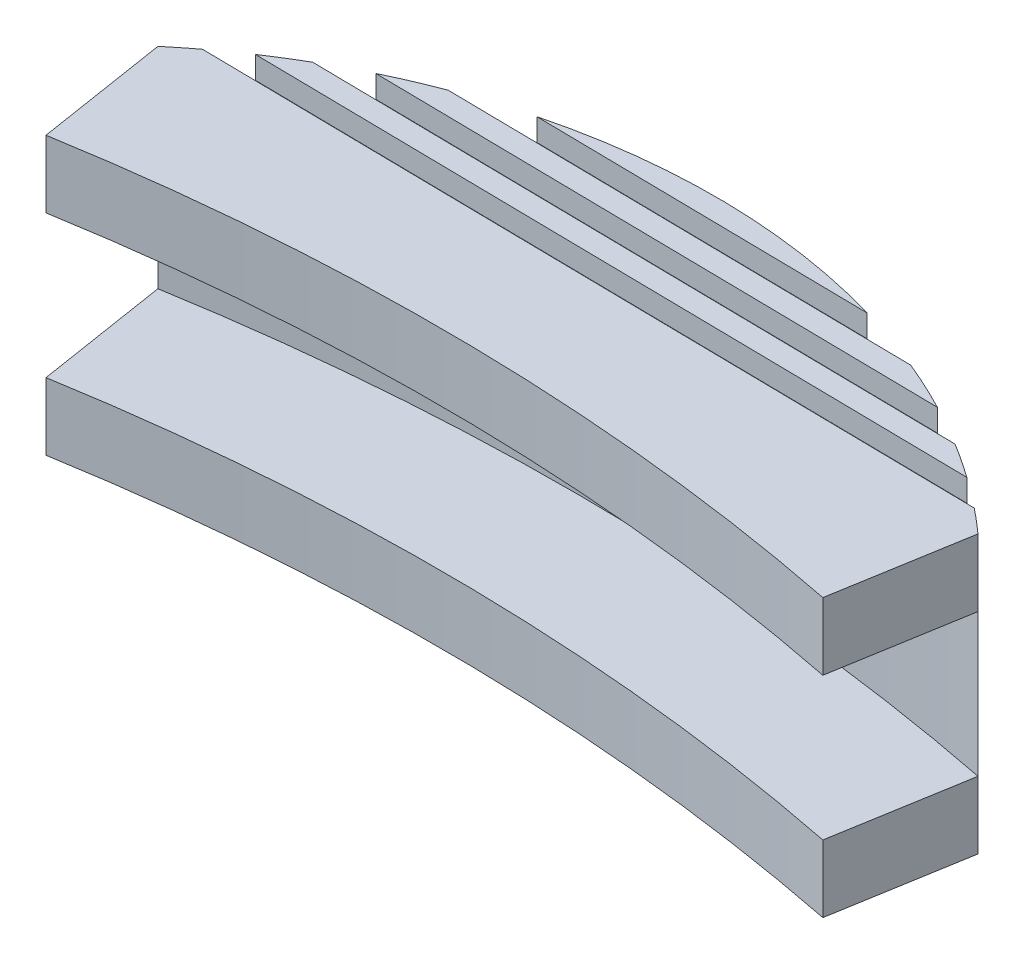
ISO-10303-21;
HEADER;
FILE_DESCRIPTION(('STEP AP214'),'2;1');
FILE_NAME('part.step','',(''),(''),'','','');
FILE_SCHEMA(('AUTOMOTIVE_DESIGN { 1 0 10303 214 1 1 1 1 }'));
ENDSEC;
DATA;
#1=APPLICATION_CONTEXT('core data for automotive mechanical design processes');
#2=APPLICATION_PROTOCOL_DEFINITION('international standard','automotive_design',2000,#1);
#3=PRODUCT_CONTEXT('',#1,'mechanical');
#4=PRODUCT('Part','Part','',(#3));
#5=PRODUCT_RELATED_PRODUCT_CATEGORY('part','',(#4));
#6=PRODUCT_DEFINITION_FORMATION('','',#4);
#7=PRODUCT_DEFINITION_CONTEXT('part definition',#1,'design');
#8=PRODUCT_DEFINITION('design','',#6,#7);
#9=PRODUCT_DEFINITION_SHAPE('','',#8);
#10=(LENGTH_UNIT() NAMED_UNIT(*) SI_UNIT(.MILLI.,.METRE.));
#11=(NAMED_UNIT(*) PLANE_ANGLE_UNIT() SI_UNIT($,.RADIAN.));
#12=(NAMED_UNIT(*) SI_UNIT($,.STERADIAN.) SOLID_ANGLE_UNIT());
#13=UNCERTAINTY_MEASURE_WITH_UNIT(LENGTH_MEASURE(1.E-05),#10,'distance_accuracy_value','');
#14=(GEOMETRIC_REPRESENTATION_CONTEXT(3) GLOBAL_UNCERTAINTY_ASSIGNED_CONTEXT((#13)) GLOBAL_UNIT_ASSIGNED_CONTEXT((#10,
#11,#12)) REPRESENTATION_CONTEXT('',''));
#15=CARTESIAN_POINT('',(0.,0.,0.));
#16=DIRECTION('',(0.,0.,1.));
#17=DIRECTION('',(1.,0.,0.));
#18=AXIS2_PLACEMENT_3D('',#15,#16,#17);
#19=CARTESIAN_POINT('',(-48.9061099360698,-35.3615888271444,-205.982538335919));
#20=DIRECTION('',(0.,1.,0.));
#21=DIRECTION('',(-1.,0.,0.));
#22=AXIS2_PLACEMENT_3D('',#19,#20,#21);
#23=PLANE('',#22);
#24=DIRECTION('',(0.999893185877506,0.,0.0146156366858123));
#25=VECTOR('',#24,1.);
#26=CARTESIAN_POINT('',(4.49370903338518,-35.3615888271444,-307.426158599009));
#27=LINE('',#26,#25);
#28=CARTESIAN_POINT('',(-64.8725313397905,-35.3615888271444,-308.440098669683));
#29=VERTEX_POINT('',#28);
#30=CARTESIAN_POINT('',(-29.9518648746335,-35.3615888271444,-307.929656373356));
#31=VERTEX_POINT('',#30);
#32=EDGE_CURVE('E290',#29,#31,#27,.T.);
#33=ORIENTED_EDGE('',*,*,#32,.T.);
#34=CARTESIAN_POINT('',(-47.7397447251398,-35.3615888271444,-285.776573431618));
#35=DIRECTION('',(0.,1.,0.));
#36=DIRECTION('',(-1.,0.,0.));
#37=AXIS2_PLACEMENT_3D('',#34,#35,#36);
#38=CIRCLE('',#37,28.4106978689293);
#39=CARTESIAN_POINT('',(-28.8689573308058,-35.3615888271444,-307.014773367522));
#40=VERTEX_POINT('',#39);
#41=EDGE_CURVE('E451',#40,#31,#38,.T.);
#42=ORIENTED_EDGE('',*,*,#41,.F.);
#43=DIRECTION('',(-0.166595258524325,0.,0.986025364702761));
#44=VECTOR('',#43,1.);
#45=CARTESIAN_POINT('',(-28.8689573308058,-35.3615888271444,-307.014773367522));
#46=LINE('',#45,#44);
#47=CARTESIAN_POINT('',(-29.8689573308058,-35.3615888271444,-301.096085324195));
#48=VERTEX_POINT('',#47);
#49=EDGE_CURVE('E467',#40,#48,#46,.T.);
#50=ORIENTED_EDGE('',*,*,#49,.T.);
#51=CARTESIAN_POINT('',(-48.9061099360698,-35.3615888271444,-205.982538335933));
#52=DIRECTION('',(0.,1.,0.));
#53=DIRECTION('',(-1.,0.,0.));
#54=AXIS2_PLACEMENT_3D('',#51,#52,#53);
#55=CIRCLE('',#54,97.0000000000232);
#56=CARTESIAN_POINT('',(-65.0444673599447,-35.3615888271444,-301.630608989051));
#57=VERTEX_POINT('',#56);
#58=EDGE_CURVE('E469',#48,#57,#55,.T.);
#59=ORIENTED_EDGE('',*,*,#58,.T.);
#60=DIRECTION('',(-0.156200383658451,0.,-0.987725387010455));
#61=VECTOR('',#60,1.);
#62=CARTESIAN_POINT('',(-65.9817165677481,-35.3615888271444,-307.557257917948));
#63=LINE('',#62,#61);
#64=CARTESIAN_POINT('',(-65.9817165677481,-35.3615888271444,-307.557257917948));
#65=VERTEX_POINT('',#64);
#66=EDGE_CURVE('E472',#57,#65,#63,.T.);
#67=ORIENTED_EDGE('',*,*,#66,.T.);
#68=EDGE_CURVE('E449',#29,#65,#38,.T.);
#69=ORIENTED_EDGE('',*,*,#68,.F.);
#70=EDGE_LOOP('',(#33,#42,#50,#59,#67,#69));
#71=FACE_BOUND('',#70,.T.);
#72=ADVANCED_FACE('F60',(#71),#23,.F.);
#73=CARTESIAN_POINT('',(-31.3025015736685,-35.3615888271444,-308.949505722957));
#74=VERTEX_POINT('',#73);
#75=CARTESIAN_POINT('',(-32.8488535552888,-35.3615888271444,-309.972215881597));
#76=VERTEX_POINT('',#75);
#77=EDGE_CURVE('E454',#74,#76,#38,.T.);
#78=ORIENTED_EDGE('',*,*,#77,.F.);
#79=DIRECTION('',(0.999893185877506,0.,0.0146156366858128));
#80=VECTOR('',#79,1.);
#81=CARTESIAN_POINT('',(4.50832467007113,-35.3615888271444,-308.426051784887));
#82=LINE('',#81,#80);
#83=CARTESIAN_POINT('',(-63.4926633673838,-35.3615888271444,-309.420035691837));
#84=VERTEX_POINT('',#83);
#85=EDGE_CURVE('E275',#84,#74,#82,.T.);
#86=ORIENTED_EDGE('',*,*,#85,.F.);
#87=CARTESIAN_POINT('',(-61.9170801123919,-35.3615888271444,-310.397111904952));
#88=VERTEX_POINT('',#87);
#89=EDGE_CURVE('E304',#88,#84,#38,.T.);
#90=ORIENTED_EDGE('',*,*,#89,.F.);
#91=DIRECTION('',(0.999893185877506,0.,0.0146156366858129));
#92=VECTOR('',#91,1.);
#93=CARTESIAN_POINT('',(4.52294030675697,-35.3615888271444,-309.425944970764));
#94=LINE('',#93,#92);
#95=EDGE_CURVE('E319',#88,#76,#94,.T.);
#96=ORIENTED_EDGE('',*,*,#95,.T.);
#97=EDGE_LOOP('',(#78,#86,#90,#96));
#98=FACE_BOUND('',#97,.T.);
#99=ADVANCED_FACE('F528',(#98),#23,.F.);
#100=CARTESIAN_POINT('',(-34.6628525550382,-35.3615888271444,-310.998838289697));
#101=VERTEX_POINT('',#100);
#102=CARTESIAN_POINT('',(-36.8838086299912,-35.3615888271444,-312.031409269947));
#103=VERTEX_POINT('',#102);
#104=EDGE_CURVE('E522',#101,#103,#38,.T.);
#105=ORIENTED_EDGE('',*,*,#104,.F.);
#106=DIRECTION('',(0.999893185877506,0.,0.0146156366858138));
#107=VECTOR('',#106,1.);
#108=CARTESIAN_POINT('',(4.53755594344308,-35.3615888271444,-310.425838156642));
#109=LINE('',#108,#107);
#110=CARTESIAN_POINT('',(-60.0738498392709,-35.3615888271444,-311.370275868607));
#111=VERTEX_POINT('',#110);
#112=EDGE_CURVE('E325',#111,#101,#109,.T.);
#113=ORIENTED_EDGE('',*,*,#112,.F.);
#114=CARTESIAN_POINT('',(-57.8236624909465,-35.3615888271444,-312.337491260112));
#115=VERTEX_POINT('',#114);
#116=EDGE_CURVE('E516',#115,#111,#38,.T.);
#117=ORIENTED_EDGE('',*,*,#116,.F.);
#118=DIRECTION('',(0.999893185877506,0.,0.0146156366858094));
#119=VECTOR('',#118,1.);
#120=CARTESIAN_POINT('',(4.55217158012753,-35.3615888271444,-311.425731342519));
#121=LINE('',#120,#119);
#122=EDGE_CURVE('E341',#115,#103,#121,.T.);
#123=ORIENTED_EDGE('',*,*,#122,.T.);
#124=EDGE_LOOP('',(#105,#113,#117,#123));
#125=FACE_BOUND('',#124,.T.);
#126=ADVANCED_FACE('F540',(#125),#23,.F.);
#127=CARTESIAN_POINT('',(-47.7397447251398,14.7979035606973,-285.776573431618));
#128=DIRECTION('',(0.,-1.,0.));
#129=DIRECTION('',(1.,0.,0.));
#130=AXIS2_PLACEMENT_3D('',#127,#128,#129);
#131=CYLINDRICAL_SURFACE('',#130,28.4106978689293);
#132=DIRECTION('',(0.,-1.,0.));
#133=VECTOR('',#132,1.);
#134=CARTESIAN_POINT('',(-31.3025015736685,-34.3615888271444,-308.949505722957));
#135=LINE('',#134,#133);
#136=CARTESIAN_POINT('',(-31.3025015736685,-34.3615888271444,-308.949505722957));
#137=VERTEX_POINT('',#136);
#138=EDGE_CURVE('E269',#137,#74,#135,.T.);
#139=ORIENTED_EDGE('',*,*,#138,.T.);
#140=ORIENTED_EDGE('',*,*,#77,.T.);
#141=DIRECTION('',(0.,-1.,0.));
#142=VECTOR('',#141,1.);
#143=CARTESIAN_POINT('',(-32.8488535552887,-34.3615888271444,-309.972215881597));
#144=LINE('',#143,#142);
#145=CARTESIAN_POINT('',(-32.8488535552887,-34.3615888271444,-309.972215881597));
#146=VERTEX_POINT('',#145);
#147=EDGE_CURVE('E83',#146,#76,#144,.T.);
#148=ORIENTED_EDGE('',*,*,#147,.F.);
#149=CARTESIAN_POINT('',(-47.7397447251398,-34.3615888271444,-285.776573431618));
#150=DIRECTION('',(0.,1.,0.));
#151=DIRECTION('',(0.,0.,1.));
#152=AXIS2_PLACEMENT_3D('',#149,#150,#151);
#153=CIRCLE('',#152,28.4106978689293);
#154=CARTESIAN_POINT('',(-34.6628525550382,-34.3615888271444,-310.998838289697));
#155=VERTEX_POINT('',#154);
#156=EDGE_CURVE('E318',#146,#155,#153,.T.);
#157=ORIENTED_EDGE('',*,*,#156,.T.);
#158=DIRECTION('',(0.,-1.,0.));
#159=VECTOR('',#158,1.);
#160=CARTESIAN_POINT('',(-34.6628525550382,-34.3615888271444,-310.998838289697));
#161=LINE('',#160,#159);
#162=EDGE_CURVE('E334',#155,#101,#161,.T.);
#163=ORIENTED_EDGE('',*,*,#162,.T.);
#164=ORIENTED_EDGE('',*,*,#104,.T.);
#165=DIRECTION('',(0.,-1.,0.));
#166=VECTOR('',#165,1.);
#167=CARTESIAN_POINT('',(-36.8838086299912,-34.3615888271444,-312.031409269947));
#168=LINE('',#167,#166);
#169=CARTESIAN_POINT('',(-36.8838086299912,-34.3615888271444,-312.031409269947));
#170=VERTEX_POINT('',#169);
#171=EDGE_CURVE('E75',#170,#103,#168,.T.);
#172=ORIENTED_EDGE('',*,*,#171,.F.);
#173=CARTESIAN_POINT('',(-47.7397447251398,-34.3615888271444,-285.776573431618));
#174=DIRECTION('',(0.,1.,0.));
#175=DIRECTION('',(0.,0.,1.));
#176=AXIS2_PLACEMENT_3D('',#173,#174,#175);
#177=CIRCLE('',#176,28.4106978689293);
#178=CARTESIAN_POINT('',(-39.8685462277447,-34.3615888271444,-313.075144595951));
#179=VERTEX_POINT('',#178);
#180=EDGE_CURVE('E340',#170,#179,#177,.T.);
#181=ORIENTED_EDGE('',*,*,#180,.T.);
#182=DIRECTION('',(0.,-1.,0.));
#183=VECTOR('',#182,1.);
#184=CARTESIAN_POINT('',(-39.8685462277447,-34.3615888271444,-313.075144595951));
#185=LINE('',#184,#183);
#186=CARTESIAN_POINT('',(-39.8685462277447,-35.3615888271444,-313.075144595951));
#187=VERTEX_POINT('',#186);
#188=EDGE_CURVE('E355',#179,#187,#185,.T.);
#189=ORIENTED_EDGE('',*,*,#188,.T.);
#190=CARTESIAN_POINT('',(-54.8096936198211,-35.3615888271444,-313.293542305863));
#191=VERTEX_POINT('',#190);
#192=EDGE_CURVE('E518',#187,#191,#38,.T.);
#193=ORIENTED_EDGE('',*,*,#192,.T.);
#194=DIRECTION('',(0.,-1.,0.));
#195=VECTOR('',#194,1.);
#196=CARTESIAN_POINT('',(-54.8096936198211,-34.3615888271444,-313.293542305863));
#197=LINE('',#196,#195);
#198=CARTESIAN_POINT('',(-54.8096936198211,-34.3615888271444,-313.293542305863));
#199=VERTEX_POINT('',#198);
#200=EDGE_CURVE('E327',#199,#191,#197,.T.);
#201=ORIENTED_EDGE('',*,*,#200,.F.);
#202=CARTESIAN_POINT('',(-57.8236624909465,-34.3615888271444,-312.337491260112));
#203=VERTEX_POINT('',#202);
#204=EDGE_CURVE('E345',#199,#203,#177,.T.);
#205=ORIENTED_EDGE('',*,*,#204,.T.);
#206=DIRECTION('',(0.,-1.,0.));
#207=VECTOR('',#206,1.);
#208=CARTESIAN_POINT('',(-57.8236624909465,-34.3615888271444,-312.337491260112));
#209=LINE('',#208,#207);
#210=EDGE_CURVE('E351',#203,#115,#209,.T.);
#211=ORIENTED_EDGE('',*,*,#210,.T.);
#212=ORIENTED_EDGE('',*,*,#116,.T.);
#213=DIRECTION('',(0.,-1.,0.));
#214=VECTOR('',#213,1.);
#215=CARTESIAN_POINT('',(-60.0738498392709,-34.3615888271444,-311.370275868607));
#216=LINE('',#215,#214);
#217=CARTESIAN_POINT('',(-60.0738498392709,-34.3615888271444,-311.370275868607));
#218=VERTEX_POINT('',#217);
#219=EDGE_CURVE('E329',#218,#111,#216,.T.);
#220=ORIENTED_EDGE('',*,*,#219,.F.);
#221=CARTESIAN_POINT('',(-61.9170801123919,-34.3615888271444,-310.397111904952));
#222=VERTEX_POINT('',#221);
#223=EDGE_CURVE('E323',#218,#222,#153,.T.);
#224=ORIENTED_EDGE('',*,*,#223,.T.);
#225=DIRECTION('',(0.,-1.,0.));
#226=VECTOR('',#225,1.);
#227=CARTESIAN_POINT('',(-61.9170801123919,-34.3615888271444,-310.397111904952));
#228=LINE('',#227,#226);
#229=EDGE_CURVE('E331',#222,#88,#228,.T.);
#230=ORIENTED_EDGE('',*,*,#229,.T.);
#231=ORIENTED_EDGE('',*,*,#89,.T.);
#232=DIRECTION('',(0.,-1.,0.));
#233=VECTOR('',#232,1.);
#234=CARTESIAN_POINT('',(-63.4926633673838,-34.3615888271444,-309.420035691837));
#235=LINE('',#234,#233);
#236=CARTESIAN_POINT('',(-63.4926633673838,-34.3615888271444,-309.420035691837));
#237=VERTEX_POINT('',#236);
#238=EDGE_CURVE('E301',#237,#84,#235,.T.);
#239=ORIENTED_EDGE('',*,*,#238,.F.);
#240=CARTESIAN_POINT('',(-47.7397447251398,-34.3615888271444,-285.776573431618));
#241=DIRECTION('',(0.,1.,0.));
#242=DIRECTION('',(0.,0.,1.));
#243=AXIS2_PLACEMENT_3D('',#240,#241,#242);
#244=CIRCLE('',#243,28.4106978689293);
#245=CARTESIAN_POINT('',(-64.8725313397905,-34.3615888271444,-308.440098669683));
#246=VERTEX_POINT('',#245);
#247=EDGE_CURVE('E281',#237,#246,#244,.T.);
#248=ORIENTED_EDGE('',*,*,#247,.T.);
#249=DIRECTION('',(0.,-1.,0.));
#250=VECTOR('',#249,1.);
#251=CARTESIAN_POINT('',(-64.8725313397905,-34.3615888271444,-308.440098669683));
#252=LINE('',#251,#250);
#253=EDGE_CURVE('E298',#246,#29,#252,.T.);
#254=ORIENTED_EDGE('',*,*,#253,.T.);
#255=ORIENTED_EDGE('',*,*,#68,.T.);
#256=DIRECTION('',(0.,1.,0.));
#257=VECTOR('',#256,1.);
#258=CARTESIAN_POINT('',(-65.9817165677481,-35.3615888271444,-307.557257917948));
#259=LINE('',#258,#257);
#260=CARTESIAN_POINT('',(-65.9817165677481,-32.3615888271444,-307.557257917948));
#261=VERTEX_POINT('',#260);
#262=EDGE_CURVE('E475',#65,#261,#259,.T.);
#263=ORIENTED_EDGE('',*,*,#262,.T.);
#264=DIRECTION('',(0.,-1.,0.));
#265=VECTOR('',#264,1.);
#266=CARTESIAN_POINT('',(-65.9817165677481,14.7979035606973,-307.557257917948));
#267=LINE('',#266,#265);
#268=CARTESIAN_POINT('',(-65.9817165677481,-26.0015888271444,-307.557257917948));
#269=VERTEX_POINT('',#268);
#270=EDGE_CURVE('E463',#269,#261,#267,.T.);
#271=ORIENTED_EDGE('',*,*,#270,.F.);
#272=CARTESIAN_POINT('',(-65.9817165677481,-23.0015888271444,-307.557257917948));
#273=VERTEX_POINT('',#272);
#274=EDGE_CURVE('E464',#273,#269,#267,.T.);
#275=ORIENTED_EDGE('',*,*,#274,.F.);
#276=CARTESIAN_POINT('',(-47.7397447251398,-23.0015888271444,-285.776573431618));
#277=DIRECTION('',(0.,1.,0.));
#278=DIRECTION('',(-1.,0.,0.));
#279=AXIS2_PLACEMENT_3D('',#276,#277,#278);
#280=CIRCLE('',#279,28.4106978689293);
#281=CARTESIAN_POINT('',(-64.8725313397905,-23.0015888271444,-308.440098669683));
#282=VERTEX_POINT('',#281);
#283=EDGE_CURVE('E455',#273,#282,#280,.F.);
#284=ORIENTED_EDGE('',*,*,#283,.T.);
#285=DIRECTION('',(0.,1.,0.));
#286=VECTOR('',#285,1.);
#287=CARTESIAN_POINT('',(-64.8725313397905,-24.0015888271444,-308.440098669683));
#288=LINE('',#287,#286);
#289=CARTESIAN_POINT('',(-64.8725313397905,-24.0015888271444,-308.440098669683));
#290=VERTEX_POINT('',#289);
#291=EDGE_CURVE('E379',#290,#282,#288,.T.);
#292=ORIENTED_EDGE('',*,*,#291,.F.);
#293=CARTESIAN_POINT('',(-47.7397447251398,-24.0015888271444,-285.776573431618));
#294=DIRECTION('',(0.,1.,0.));
#295=DIRECTION('',(0.,0.,1.));
#296=AXIS2_PLACEMENT_3D('',#293,#294,#295);
#297=CIRCLE('',#296,28.4106978689293);
#298=CARTESIAN_POINT('',(-63.4926633673838,-24.0015888271444,-309.420035691837));
#299=VERTEX_POINT('',#298);
#300=EDGE_CURVE('E360',#299,#290,#297,.T.);
#301=ORIENTED_EDGE('',*,*,#300,.F.);
#302=DIRECTION('',(0.,1.,0.));
#303=VECTOR('',#302,1.);
#304=CARTESIAN_POINT('',(-63.4926633673838,-24.0015888271444,-309.420035691837));
#305=LINE('',#304,#303);
#306=CARTESIAN_POINT('',(-63.4926633673838,-23.0015888271444,-309.420035691837));
#307=VERTEX_POINT('',#306);
#308=EDGE_CURVE('E381',#299,#307,#305,.T.);
#309=ORIENTED_EDGE('',*,*,#308,.T.);
#310=CARTESIAN_POINT('',(-61.9170801123919,-23.0015888271444,-310.397111904952));
#311=VERTEX_POINT('',#310);
#312=EDGE_CURVE('E459',#307,#311,#280,.F.);
#313=ORIENTED_EDGE('',*,*,#312,.T.);
#314=DIRECTION('',(0.,1.,0.));
#315=VECTOR('',#314,1.);
#316=CARTESIAN_POINT('',(-61.9170801123919,-24.0015888271444,-310.397111904952));
#317=LINE('',#316,#315);
#318=CARTESIAN_POINT('',(-61.9170801123919,-24.0015888271444,-310.397111904952));
#319=VERTEX_POINT('',#318);
#320=EDGE_CURVE('E403',#319,#311,#317,.T.);
#321=ORIENTED_EDGE('',*,*,#320,.F.);
#322=CARTESIAN_POINT('',(-47.7397447251398,-24.0015888271444,-285.776573431618));
#323=DIRECTION('',(0.,1.,0.));
#324=DIRECTION('',(0.,0.,1.));
#325=AXIS2_PLACEMENT_3D('',#322,#323,#324);
#326=CIRCLE('',#325,28.4106978689293);
#327=CARTESIAN_POINT('',(-60.0738498392709,-24.0015888271444,-311.370275868607));
#328=VERTEX_POINT('',#327);
#329=EDGE_CURVE('E386',#328,#319,#326,.T.);
#330=ORIENTED_EDGE('',*,*,#329,.F.);
#331=DIRECTION('',(0.,1.,0.));
#332=VECTOR('',#331,1.);
#333=CARTESIAN_POINT('',(-60.0738498392709,-24.0015888271444,-311.370275868607));
#334=LINE('',#333,#332);
#335=CARTESIAN_POINT('',(-60.0738498392709,-23.0015888271444,-311.370275868607));
#336=VERTEX_POINT('',#335);
#337=EDGE_CURVE('E405',#328,#336,#334,.T.);
#338=ORIENTED_EDGE('',*,*,#337,.T.);
#339=CARTESIAN_POINT('',(-57.8236624909465,-23.0015888271444,-312.337491260112));
#340=VERTEX_POINT('',#339);
#341=EDGE_CURVE('E934',#336,#340,#280,.F.);
#342=ORIENTED_EDGE('',*,*,#341,.T.);
#343=DIRECTION('',(0.,1.,0.));
#344=VECTOR('',#343,1.);
#345=CARTESIAN_POINT('',(-57.8236624909465,-24.0015888271444,-312.337491260112));
#346=LINE('',#345,#344);
#347=CARTESIAN_POINT('',(-57.8236624909465,-24.0015888271444,-312.337491260112));
#348=VERTEX_POINT('',#347);
#349=EDGE_CURVE('E422',#348,#340,#346,.T.);
#350=ORIENTED_EDGE('',*,*,#349,.F.);
#351=CARTESIAN_POINT('',(-47.7397447251398,-24.0015888271444,-285.776573431618));
#352=DIRECTION('',(0.,1.,0.));
#353=DIRECTION('',(0.,0.,1.));
#354=AXIS2_PLACEMENT_3D('',#351,#352,#353);
#355=CIRCLE('',#354,28.4106978689293);
#356=CARTESIAN_POINT('',(-54.8096936198211,-24.0015888271444,-313.293542305863));
#357=VERTEX_POINT('',#356);
#358=EDGE_CURVE('E410',#357,#348,#355,.T.);
#359=ORIENTED_EDGE('',*,*,#358,.F.);
#360=DIRECTION('',(0.,1.,0.));
#361=VECTOR('',#360,1.);
#362=CARTESIAN_POINT('',(-54.8096936198211,-24.0015888271444,-313.293542305863));
#363=LINE('',#362,#361);
#364=CARTESIAN_POINT('',(-54.8096936198211,-23.0015888271444,-313.293542305863));
#365=VERTEX_POINT('',#364);
#366=EDGE_CURVE('E424',#357,#365,#363,.T.);
#367=ORIENTED_EDGE('',*,*,#366,.T.);
#368=CARTESIAN_POINT('',(-39.8685462277447,-23.0015888271444,-313.075144595951));
#369=VERTEX_POINT('',#368);
#370=EDGE_CURVE('E936',#365,#369,#280,.F.);
#371=ORIENTED_EDGE('',*,*,#370,.T.);
#372=DIRECTION('',(0.,1.,0.));
#373=VECTOR('',#372,1.);
#374=CARTESIAN_POINT('',(-39.8685462277447,-24.0015888271444,-313.075144595951));
#375=LINE('',#374,#373);
#376=CARTESIAN_POINT('',(-39.8685462277447,-24.0015888271444,-313.075144595951));
#377=VERTEX_POINT('',#376);
#378=EDGE_CURVE('E397',#377,#369,#375,.T.);
#379=ORIENTED_EDGE('',*,*,#378,.F.);
#380=CARTESIAN_POINT('',(-36.8838086299912,-24.0015888271444,-312.031409269947));
#381=VERTEX_POINT('',#380);
#382=EDGE_CURVE('E414',#381,#377,#355,.T.);
#383=ORIENTED_EDGE('',*,*,#382,.F.);
#384=DIRECTION('',(0.,1.,0.));
#385=VECTOR('',#384,1.);
#386=CARTESIAN_POINT('',(-36.8838086299912,-24.0015888271444,-312.031409269947));
#387=LINE('',#386,#385);
#388=CARTESIAN_POINT('',(-36.8838086299912,-23.0015888271444,-312.031409269947));
#389=VERTEX_POINT('',#388);
#390=EDGE_CURVE('E419',#381,#389,#387,.T.);
#391=ORIENTED_EDGE('',*,*,#390,.T.);
#392=CARTESIAN_POINT('',(-34.6628525550382,-23.0015888271444,-310.998838289697));
#393=VERTEX_POINT('',#392);
#394=EDGE_CURVE('E940',#389,#393,#280,.F.);
#395=ORIENTED_EDGE('',*,*,#394,.T.);
#396=DIRECTION('',(0.,1.,0.));
#397=VECTOR('',#396,1.);
#398=CARTESIAN_POINT('',(-34.6628525550382,-24.0015888271444,-310.998838289697));
#399=LINE('',#398,#397);
#400=CARTESIAN_POINT('',(-34.6628525550382,-24.0015888271444,-310.998838289697));
#401=VERTEX_POINT('',#400);
#402=EDGE_CURVE('E371',#401,#393,#399,.T.);
#403=ORIENTED_EDGE('',*,*,#402,.F.);
#404=CARTESIAN_POINT('',(-32.8488535552887,-24.0015888271444,-309.972215881597));
#405=VERTEX_POINT('',#404);
#406=EDGE_CURVE('E391',#405,#401,#326,.T.);
#407=ORIENTED_EDGE('',*,*,#406,.F.);
#408=DIRECTION('',(0.,1.,0.));
#409=VECTOR('',#408,1.);
#410=CARTESIAN_POINT('',(-32.8488535552887,-24.0015888271444,-309.972215881597));
#411=LINE('',#410,#409);
#412=CARTESIAN_POINT('',(-32.8488535552887,-23.0015888271444,-309.972215881597));
#413=VERTEX_POINT('',#412);
#414=EDGE_CURVE('E400',#405,#413,#411,.T.);
#415=ORIENTED_EDGE('',*,*,#414,.T.);
#416=CARTESIAN_POINT('',(-31.3025015736685,-23.0015888271444,-308.949505722957));
#417=VERTEX_POINT('',#416);
#418=EDGE_CURVE('E944',#413,#417,#280,.F.);
#419=ORIENTED_EDGE('',*,*,#418,.T.);
#420=DIRECTION('',(0.,1.,0.));
#421=VECTOR('',#420,1.);
#422=CARTESIAN_POINT('',(-31.3025015736685,-24.0015888271444,-308.949505722957));
#423=LINE('',#422,#421);
#424=CARTESIAN_POINT('',(-31.3025015736685,-24.0015888271444,-308.949505722957));
#425=VERTEX_POINT('',#424);
#426=EDGE_CURVE('E373',#425,#417,#423,.T.);
#427=ORIENTED_EDGE('',*,*,#426,.F.);
#428=CARTESIAN_POINT('',(-29.9518648746335,-24.0015888271444,-307.929656373356));
#429=VERTEX_POINT('',#428);
#430=EDGE_CURVE('E365',#429,#425,#297,.T.);
#431=ORIENTED_EDGE('',*,*,#430,.F.);
#432=DIRECTION('',(0.,1.,0.));
#433=VECTOR('',#432,1.);
#434=CARTESIAN_POINT('',(-29.9518648746335,-24.0015888271444,-307.929656373356));
#435=LINE('',#434,#433);
#436=CARTESIAN_POINT('',(-29.9518648746335,-23.0015888271444,-307.929656373356));
#437=VERTEX_POINT('',#436);
#438=EDGE_CURVE('E376',#429,#437,#435,.T.);
#439=ORIENTED_EDGE('',*,*,#438,.T.);
#440=CARTESIAN_POINT('',(-28.8689573308058,-23.0015888271444,-307.014773367522));
#441=VERTEX_POINT('',#440);
#442=EDGE_CURVE('E453',#437,#441,#280,.F.);
#443=ORIENTED_EDGE('',*,*,#442,.T.);
#444=DIRECTION('',(0.,-1.,0.));
#445=VECTOR('',#444,1.);
#446=CARTESIAN_POINT('',(-28.8689573308058,14.7979035606973,-307.014773367522));
#447=LINE('',#446,#445);
#448=CARTESIAN_POINT('',(-28.8689573308058,-26.0015888271444,-307.014773367522));
#449=VERTEX_POINT('',#448);
#450=EDGE_CURVE('E460',#441,#449,#447,.T.);
#451=ORIENTED_EDGE('',*,*,#450,.T.);
#452=CARTESIAN_POINT('',(-28.8689573308058,-32.3615888271444,-307.014773367522));
#453=VERTEX_POINT('',#452);
#454=EDGE_CURVE('E458',#449,#453,#447,.T.);
#455=ORIENTED_EDGE('',*,*,#454,.T.);
#456=DIRECTION('',(0.,1.,0.));
#457=VECTOR('',#456,1.);
#458=CARTESIAN_POINT('',(-28.8689573308058,-35.3615888271444,-307.014773367522));
#459=LINE('',#458,#457);
#460=EDGE_CURVE('E12',#40,#453,#459,.T.);
#461=ORIENTED_EDGE('',*,*,#460,.F.);
#462=ORIENTED_EDGE('',*,*,#41,.T.);
#463=DIRECTION('',(0.,-1.,0.));
#464=VECTOR('',#463,1.);
#465=CARTESIAN_POINT('',(-29.9518648746335,-34.3615888271444,-307.929656373356));
#466=LINE('',#465,#464);
#467=CARTESIAN_POINT('',(-29.9518648746335,-34.3615888271444,-307.929656373356));
#468=VERTEX_POINT('',#467);
#469=EDGE_CURVE('E280',#468,#31,#466,.T.);
#470=ORIENTED_EDGE('',*,*,#469,.F.);
#471=EDGE_CURVE('E287',#468,#137,#244,.T.);
#472=ORIENTED_EDGE('',*,*,#471,.T.);
#473=EDGE_LOOP('',(#139,#140,#148,#157,#163,#164,#172,#181,#189,#193,#201,#205,#211,#212,#220,
#224,#230,#231,#239,#248,#254,#255,#263,#271,#275,#284,#292,#301,#309,#313,#321,#330,#338,#342,
#350,#359,#367,#371,#379,#383,#391,#395,#403,#407,#415,#419,#427,#431,#439,#443,#451,#455,#461,
#462,#470,#472));
#474=FACE_BOUND('',#473,.T.);
#475=ADVANCED_FACE('F292',(#474),#131,.T.);
#476=CARTESIAN_POINT('',(-48.9061099360698,-23.0015888271444,-205.982538335919));
#477=DIRECTION('',(0.,1.,0.));
#478=DIRECTION('',(-1.,0.,0.));
#479=AXIS2_PLACEMENT_3D('',#476,#477,#478);
#480=PLANE('',#479);
#481=ORIENTED_EDGE('',*,*,#312,.F.);
#482=DIRECTION('',(0.999893185877506,0.,0.0146156366858128));
#483=VECTOR('',#482,1.);
#484=CARTESIAN_POINT('',(4.50832467007113,-23.0015888271444,-308.426051784887));
#485=LINE('',#484,#483);
#486=EDGE_CURVE('E368',#307,#417,#485,.T.);
#487=ORIENTED_EDGE('',*,*,#486,.T.);
#488=ORIENTED_EDGE('',*,*,#418,.F.);
#489=DIRECTION('',(0.999893185877506,0.,0.0146156366858129));
#490=VECTOR('',#489,1.);
#491=CARTESIAN_POINT('',(4.52294030675697,-23.0015888271444,-309.425944970764));
#492=LINE('',#491,#490);
#493=EDGE_CURVE('E387',#311,#413,#492,.T.);
#494=ORIENTED_EDGE('',*,*,#493,.F.);
#495=EDGE_LOOP('',(#481,#487,#488,#494));
#496=FACE_BOUND('',#495,.T.);
#497=ADVANCED_FACE('F569',(#496),#480,.T.);
#498=ORIENTED_EDGE('',*,*,#341,.F.);
#499=DIRECTION('',(0.999893185877506,0.,0.0146156366858138));
#500=VECTOR('',#499,1.);
#501=CARTESIAN_POINT('',(4.53755594344308,-23.0015888271444,-310.425838156642));
#502=LINE('',#501,#500);
#503=EDGE_CURVE('E394',#336,#393,#502,.T.);
#504=ORIENTED_EDGE('',*,*,#503,.T.);
#505=ORIENTED_EDGE('',*,*,#394,.F.);
#506=DIRECTION('',(0.999893185877506,0.,0.0146156366858094));
#507=VECTOR('',#506,1.);
#508=CARTESIAN_POINT('',(4.55217158012753,-23.0015888271444,-311.425731342519));
#509=LINE('',#508,#507);
#510=EDGE_CURVE('E308',#340,#389,#509,.T.);
#511=ORIENTED_EDGE('',*,*,#510,.F.);
#512=EDGE_LOOP('',(#498,#504,#505,#511));
#513=FACE_BOUND('',#512,.T.);
#514=ADVANCED_FACE('F696',(#513),#480,.T.);
#515=ORIENTED_EDGE('',*,*,#370,.F.);
#516=DIRECTION('',(0.999893185877506,0.,0.0146156366858123));
#517=VECTOR('',#516,1.);
#518=CARTESIAN_POINT('',(4.56678721681424,-23.0015888271444,-312.425624528397));
#519=LINE('',#518,#517);
#520=EDGE_CURVE('E305',#365,#369,#519,.T.);
#521=ORIENTED_EDGE('',*,*,#520,.T.);
#522=EDGE_LOOP('',(#515,#521));
#523=FACE_BOUND('',#522,.T.);
#524=ADVANCED_FACE('F685',(#523),#480,.T.);
#525=CARTESIAN_POINT('',(-48.9061099360698,14.7979035606973,-205.982538335919));
#526=DIRECTION('',(0.,-1.,0.));
#527=DIRECTION('',(1.,0.,0.));
#528=AXIS2_PLACEMENT_3D('',#525,#526,#527);
#529=CYLINDRICAL_SURFACE('',#528,103.000000000037);
#530=CARTESIAN_POINT('',(-48.9061099360698,-26.0015888271444,-205.982538335919));
#531=DIRECTION('',(0.,-1.,0.));
#532=DIRECTION('',(-1.,0.,0.));
#533=AXIS2_PLACEMENT_3D('',#530,#531,#532);
#534=CIRCLE('',#533,103.000000000037);
#535=EDGE_CURVE('E375',#269,#449,#534,.T.);
#536=ORIENTED_EDGE('',*,*,#535,.F.);
#537=ORIENTED_EDGE('',*,*,#270,.T.);
#538=CARTESIAN_POINT('',(-48.9061099360698,-32.3615888271444,-205.982538335919));
#539=DIRECTION('',(0.,-1.,0.));
#540=DIRECTION('',(-1.,0.,0.));
#541=AXIS2_PLACEMENT_3D('',#538,#539,#540);
#542=CIRCLE('',#541,103.000000000037);
#543=EDGE_CURVE('E466',#261,#453,#542,.T.);
#544=ORIENTED_EDGE('',*,*,#543,.T.);
#545=ORIENTED_EDGE('',*,*,#454,.F.);
#546=EDGE_LOOP('',(#536,#537,#544,#545));
#547=FACE_BOUND('',#546,.T.);
#548=ADVANCED_FACE('F513',(#547),#529,.F.);
#549=CARTESIAN_POINT('',(-28.8689573308058,-35.3615888271444,-307.014773367522));
#550=DIRECTION('',(-0.986025364702761,0.,-0.166595258524325));
#551=DIRECTION('',(-0.166595258524325,0.,0.986025364702761));
#552=AXIS2_PLACEMENT_3D('',#549,#550,#551);
#553=PLANE('',#552);
#554=DIRECTION('',(-0.166595258524325,0.,0.986025364702761));
#555=VECTOR('',#554,1.);
#556=CARTESIAN_POINT('',(-28.8689573308058,-32.3615888271444,-307.014773367522));
#557=LINE('',#556,#555);
#558=CARTESIAN_POINT('',(-29.8689573308058,-32.3615888271444,-301.096085324195));
#559=VERTEX_POINT('',#558);
#560=EDGE_CURVE('E478',#453,#559,#557,.T.);
#561=ORIENTED_EDGE('',*,*,#560,.T.);
#562=DIRECTION('',(0.,1.,0.));
#563=VECTOR('',#562,1.);
#564=CARTESIAN_POINT('',(-29.8689573308058,-35.3615888271444,-301.096085324195));
#565=LINE('',#564,#563);
#566=EDGE_CURVE('E68',#48,#559,#565,.T.);
#567=ORIENTED_EDGE('',*,*,#566,.F.);
#568=ORIENTED_EDGE('',*,*,#49,.F.);
#569=ORIENTED_EDGE('',*,*,#460,.T.);
#570=EDGE_LOOP('',(#561,#567,#568,#569));
#571=FACE_BOUND('',#570,.T.);
#572=ADVANCED_FACE('F62',(#571),#553,.F.);
#573=CARTESIAN_POINT('',(-48.9061099360698,-35.3615888271444,-205.982538335933));
#574=DIRECTION('',(0.,1.,0.));
#575=DIRECTION('',(-1.,0.,0.));
#576=AXIS2_PLACEMENT_3D('',#573,#574,#575);
#577=CYLINDRICAL_SURFACE('',#576,97.0000000000232);
#578=CARTESIAN_POINT('',(-48.9061099360698,-32.3615888271444,-205.982538335933));
#579=DIRECTION('',(0.,1.,0.));
#580=DIRECTION('',(-1.,0.,0.));
#581=AXIS2_PLACEMENT_3D('',#578,#579,#580);
#582=CIRCLE('',#581,97.0000000000232);
#583=CARTESIAN_POINT('',(-65.0444673599447,-32.3615888271444,-301.630608989051));
#584=VERTEX_POINT('',#583);
#585=EDGE_CURVE('E480',#559,#584,#582,.T.);
#586=ORIENTED_EDGE('',*,*,#585,.T.);
#587=DIRECTION('',(0.,1.,0.));
#588=VECTOR('',#587,1.);
#589=CARTESIAN_POINT('',(-65.0444673599447,-35.3615888271444,-301.630608989051));
#590=LINE('',#589,#588);
#591=EDGE_CURVE('E486',#57,#584,#590,.T.);
#592=ORIENTED_EDGE('',*,*,#591,.F.);
#593=ORIENTED_EDGE('',*,*,#58,.F.);
#594=ORIENTED_EDGE('',*,*,#566,.T.);
#595=EDGE_LOOP('',(#586,#592,#593,#594));
#596=FACE_BOUND('',#595,.T.);
#597=ADVANCED_FACE('F493',(#596),#577,.F.);
#598=CARTESIAN_POINT('',(-65.9817165677481,-35.3615888271444,-307.557257917948));
#599=DIRECTION('',(0.987725387010455,0.,-0.156200383658451));
#600=DIRECTION('',(-0.156200383658451,0.,-0.987725387010455));
#601=AXIS2_PLACEMENT_3D('',#598,#599,#600);
#602=PLANE('',#601);
#603=DIRECTION('',(-0.156200383658451,0.,-0.987725387010455));
#604=VECTOR('',#603,1.);
#605=CARTESIAN_POINT('',(-65.9817165677481,-32.3615888271444,-307.557257917948));
#606=LINE('',#605,#604);
#607=EDGE_CURVE('E470',#584,#261,#606,.T.);
#608=ORIENTED_EDGE('',*,*,#607,.T.);
#609=ORIENTED_EDGE('',*,*,#262,.F.);
#610=ORIENTED_EDGE('',*,*,#66,.F.);
#611=ORIENTED_EDGE('',*,*,#591,.T.);
#612=EDGE_LOOP('',(#608,#609,#610,#611));
#613=FACE_BOUND('',#612,.T.);
#614=ADVANCED_FACE('F503',(#613),#602,.F.);
#615=ORIENTED_EDGE('',*,*,#192,.F.);
#616=DIRECTION('',(0.999893185877506,0.,0.0146156366858123));
#617=VECTOR('',#616,1.);
#618=CARTESIAN_POINT('',(4.56678721681424,-35.3615888271444,-312.425624528397));
#619=LINE('',#618,#617);
#620=EDGE_CURVE('E347',#191,#187,#619,.T.);
#621=ORIENTED_EDGE('',*,*,#620,.F.);
#622=EDGE_LOOP('',(#615,#621));
#623=FACE_BOUND('',#622,.T.);
#624=ADVANCED_FACE('F552',(#623),#23,.F.);
#625=CARTESIAN_POINT('',(-48.9061099360698,-32.3615888271444,-205.982538335919));
#626=DIRECTION('',(0.,1.,0.));
#627=DIRECTION('',(-1.,0.,0.));
#628=AXIS2_PLACEMENT_3D('',#625,#626,#627);
#629=PLANE('',#628);
#630=ORIENTED_EDGE('',*,*,#543,.F.);
#631=ORIENTED_EDGE('',*,*,#607,.F.);
#632=ORIENTED_EDGE('',*,*,#585,.F.);
#633=ORIENTED_EDGE('',*,*,#560,.F.);
#634=EDGE_LOOP('',(#630,#631,#632,#633));
#635=FACE_BOUND('',#634,.T.);
#636=ADVANCED_FACE('F500',(#635),#629,.T.);
#637=DIRECTION('',(0.999893185877506,0.,0.0146156366858123));
#638=VECTOR('',#637,1.);
#639=CARTESIAN_POINT('',(4.49370903338518,-23.0015888271444,-307.426158599009));
#640=LINE('',#639,#638);
#641=EDGE_CURVE('E361',#282,#437,#640,.T.);
#642=ORIENTED_EDGE('',*,*,#641,.F.);
#643=ORIENTED_EDGE('',*,*,#283,.F.);
#644=DIRECTION('',(-0.156200383658451,0.,-0.987725387010455));
#645=VECTOR('',#644,1.);
#646=CARTESIAN_POINT('',(-65.9817165677481,-23.0015888271444,-307.557257917948));
#647=LINE('',#646,#645);
#648=CARTESIAN_POINT('',(-65.0444673599447,-23.0015888271444,-301.630608989051));
#649=VERTEX_POINT('',#648);
#650=EDGE_CURVE('E434',#649,#273,#647,.T.);
#651=ORIENTED_EDGE('',*,*,#650,.F.);
#652=CARTESIAN_POINT('',(-48.9061099360698,-23.0015888271444,-205.982538335933));
#653=DIRECTION('',(0.,1.,0.));
#654=DIRECTION('',(-1.,0.,0.));
#655=AXIS2_PLACEMENT_3D('',#652,#653,#654);
#656=CIRCLE('',#655,97.0000000000232);
#657=CARTESIAN_POINT('',(-29.8689573308058,-23.0015888271444,-301.096085324195));
#658=VERTEX_POINT('',#657);
#659=EDGE_CURVE('E430',#658,#649,#656,.T.);
#660=ORIENTED_EDGE('',*,*,#659,.F.);
#661=DIRECTION('',(-0.166595258524325,0.,0.986025364702761));
#662=VECTOR('',#661,1.);
#663=CARTESIAN_POINT('',(-28.8689573308058,-23.0015888271444,-307.014773367522));
#664=LINE('',#663,#662);
#665=EDGE_CURVE('E427',#441,#658,#664,.T.);
#666=ORIENTED_EDGE('',*,*,#665,.F.);
#667=ORIENTED_EDGE('',*,*,#442,.F.);
#668=EDGE_LOOP('',(#642,#643,#651,#660,#666,#667));
#669=FACE_BOUND('',#668,.T.);
#670=ADVANCED_FACE('F559',(#669),#480,.T.);
#671=CARTESIAN_POINT('',(-65.9817165677481,-23.0015888271444,-307.557257917948));
#672=DIRECTION('',(-0.987725387010455,0.,0.156200383658451));
#673=DIRECTION('',(0.156200383658451,0.,0.987725387010455));
#674=AXIS2_PLACEMENT_3D('',#671,#672,#673);
#675=PLANE('',#674);
#676=DIRECTION('',(-0.156200383658451,0.,-0.987725387010455));
#677=VECTOR('',#676,1.);
#678=CARTESIAN_POINT('',(-65.9817165677481,-26.0015888271444,-307.557257917948));
#679=LINE('',#678,#677);
#680=CARTESIAN_POINT('',(-65.0444673599447,-26.0015888271444,-301.630608989051));
#681=VERTEX_POINT('',#680);
#682=EDGE_CURVE('E431',#681,#269,#679,.T.);
#683=ORIENTED_EDGE('',*,*,#682,.F.);
#684=DIRECTION('',(0.,-1.,0.));
#685=VECTOR('',#684,1.);
#686=CARTESIAN_POINT('',(-65.0444673599447,-23.0015888271444,-301.630608989051));
#687=LINE('',#686,#685);
#688=EDGE_CURVE('E447',#649,#681,#687,.T.);
#689=ORIENTED_EDGE('',*,*,#688,.F.);
#690=ORIENTED_EDGE('',*,*,#650,.T.);
#691=ORIENTED_EDGE('',*,*,#274,.T.);
#692=EDGE_LOOP('',(#683,#689,#690,#691));
#693=FACE_BOUND('',#692,.T.);
#694=ADVANCED_FACE('F683',(#693),#675,.T.);
#695=CARTESIAN_POINT('',(-48.9061099360698,-23.0015888271444,-205.982538335933));
#696=DIRECTION('',(0.,-1.,0.));
#697=DIRECTION('',(1.,0.,0.));
#698=AXIS2_PLACEMENT_3D('',#695,#696,#697);
#699=CYLINDRICAL_SURFACE('',#698,97.0000000000232);
#700=CARTESIAN_POINT('',(-48.9061099360698,-26.0015888271444,-205.982538335933));
#701=DIRECTION('',(0.,1.,0.));
#702=DIRECTION('',(-1.,0.,0.));
#703=AXIS2_PLACEMENT_3D('',#700,#701,#702);
#704=CIRCLE('',#703,97.0000000000232);
#705=CARTESIAN_POINT('',(-29.8689573308058,-26.0015888271444,-301.096085324195));
#706=VERTEX_POINT('',#705);
#707=EDGE_CURVE('E442',#706,#681,#704,.T.);
#708=ORIENTED_EDGE('',*,*,#707,.F.);
#709=DIRECTION('',(0.,-1.,0.));
#710=VECTOR('',#709,1.);
#711=CARTESIAN_POINT('',(-29.8689573308058,-23.0015888271444,-301.096085324195));
#712=LINE('',#711,#710);
#713=EDGE_CURVE('E436',#658,#706,#712,.T.);
#714=ORIENTED_EDGE('',*,*,#713,.F.);
#715=ORIENTED_EDGE('',*,*,#659,.T.);
#716=ORIENTED_EDGE('',*,*,#688,.T.);
#717=EDGE_LOOP('',(#708,#714,#715,#716));
#718=FACE_BOUND('',#717,.T.);
#719=ADVANCED_FACE('F738',(#718),#699,.F.);
#720=CARTESIAN_POINT('',(-28.8689573308058,-23.0015888271444,-307.014773367522));
#721=DIRECTION('',(0.986025364702761,0.,0.166595258524325));
#722=DIRECTION('',(0.166595258524325,0.,-0.986025364702761));
#723=AXIS2_PLACEMENT_3D('',#720,#721,#722);
#724=PLANE('',#723);
#725=DIRECTION('',(-0.166595258524325,0.,0.986025364702761));
#726=VECTOR('',#725,1.);
#727=CARTESIAN_POINT('',(-28.8689573308058,-26.0015888271444,-307.014773367522));
#728=LINE('',#727,#726);
#729=EDGE_CURVE('E439',#449,#706,#728,.T.);
#730=ORIENTED_EDGE('',*,*,#729,.F.);
#731=ORIENTED_EDGE('',*,*,#450,.F.);
#732=ORIENTED_EDGE('',*,*,#665,.T.);
#733=ORIENTED_EDGE('',*,*,#713,.T.);
#734=EDGE_LOOP('',(#730,#731,#732,#733));
#735=FACE_BOUND('',#734,.T.);
#736=ADVANCED_FACE('F727',(#735),#724,.T.);
#737=CARTESIAN_POINT('',(-48.9061099360698,-26.0015888271444,-205.982538335919));
#738=DIRECTION('',(0.,1.,0.));
#739=DIRECTION('',(-1.,0.,0.));
#740=AXIS2_PLACEMENT_3D('',#737,#738,#739);
#741=PLANE('',#740);
#742=ORIENTED_EDGE('',*,*,#535,.T.);
#743=ORIENTED_EDGE('',*,*,#729,.T.);
#744=ORIENTED_EDGE('',*,*,#707,.T.);
#745=ORIENTED_EDGE('',*,*,#682,.T.);
#746=EDGE_LOOP('',(#742,#743,#744,#745));
#747=FACE_BOUND('',#746,.T.);
#748=ADVANCED_FACE('F671',(#747),#741,.F.);
#749=CARTESIAN_POINT('',(4.56678721681424,-24.0015888271444,-312.425624528397));
#750=DIRECTION('',(-0.0146156366858123,0.,0.999893185877506));
#751=DIRECTION('',(0.999893185877506,0.,0.0146156366858123));
#752=AXIS2_PLACEMENT_3D('',#749,#750,#751);
#753=PLANE('',#752);
#754=ORIENTED_EDGE('',*,*,#520,.F.);
#755=ORIENTED_EDGE('',*,*,#366,.F.);
#756=DIRECTION('',(0.999893185877506,0.,0.0146156366858123));
#757=VECTOR('',#756,1.);
#758=CARTESIAN_POINT('',(4.56678721681424,-24.0015888271444,-312.425624528397));
#759=LINE('',#758,#757);
#760=EDGE_CURVE('E408',#357,#377,#759,.T.);
#761=ORIENTED_EDGE('',*,*,#760,.T.);
#762=ORIENTED_EDGE('',*,*,#378,.T.);
#763=EDGE_LOOP('',(#754,#755,#761,#762));
#764=FACE_BOUND('',#763,.T.);
#765=ADVANCED_FACE('F661',(#764),#753,.T.);
#766=CARTESIAN_POINT('',(4.55217158012753,-24.0015888271444,-311.425731342519));
#767=DIRECTION('',(-0.0146156366858094,0.,0.999893185877506));
#768=DIRECTION('',(0.999893185877506,0.,0.0146156366858094));
#769=AXIS2_PLACEMENT_3D('',#766,#767,#768);
#770=PLANE('',#769);
#771=ORIENTED_EDGE('',*,*,#510,.T.);
#772=ORIENTED_EDGE('',*,*,#390,.F.);
#773=DIRECTION('',(0.999893185877506,0.,0.0146156366858094));
#774=VECTOR('',#773,1.);
#775=CARTESIAN_POINT('',(4.55217158012753,-24.0015888271444,-311.425731342519));
#776=LINE('',#775,#774);
#777=EDGE_CURVE('E413',#348,#381,#776,.T.);
#778=ORIENTED_EDGE('',*,*,#777,.F.);
#779=ORIENTED_EDGE('',*,*,#349,.T.);
#780=EDGE_LOOP('',(#771,#772,#778,#779));
#781=FACE_BOUND('',#780,.T.);
#782=ADVANCED_FACE('F651',(#781),#770,.F.);
#783=CARTESIAN_POINT('',(0.,-24.0015888271444,0.));
#784=DIRECTION('',(0.,1.,0.));
#785=DIRECTION('',(0.,0.,1.));
#786=AXIS2_PLACEMENT_3D('',#783,#784,#785);
#787=PLANE('',#786);
#788=ORIENTED_EDGE('',*,*,#760,.F.);
#789=ORIENTED_EDGE('',*,*,#358,.T.);
#790=ORIENTED_EDGE('',*,*,#777,.T.);
#791=ORIENTED_EDGE('',*,*,#382,.T.);
#792=EDGE_LOOP('',(#788,#789,#790,#791));
#793=FACE_BOUND('',#792,.T.);
#794=ADVANCED_FACE('F641',(#793),#787,.T.);
#795=CARTESIAN_POINT('',(4.53755594344308,-24.0015888271444,-310.425838156642));
#796=DIRECTION('',(-0.0146156366858138,0.,0.999893185877506));
#797=DIRECTION('',(0.999893185877506,0.,0.0146156366858138));
#798=AXIS2_PLACEMENT_3D('',#795,#796,#797);
#799=PLANE('',#798);
#800=ORIENTED_EDGE('',*,*,#503,.F.);
#801=ORIENTED_EDGE('',*,*,#337,.F.);
#802=DIRECTION('',(0.999893185877506,0.,0.0146156366858138));
#803=VECTOR('',#802,1.);
#804=CARTESIAN_POINT('',(4.53755594344308,-24.0015888271444,-310.425838156642));
#805=LINE('',#804,#803);
#806=EDGE_CURVE('E384',#328,#401,#805,.T.);
#807=ORIENTED_EDGE('',*,*,#806,.T.);
#808=ORIENTED_EDGE('',*,*,#402,.T.);
#809=EDGE_LOOP('',(#800,#801,#807,#808));
#810=FACE_BOUND('',#809,.T.);
#811=ADVANCED_FACE('F631',(#810),#799,.T.);
#812=CARTESIAN_POINT('',(4.52294030675697,-24.0015888271444,-309.425944970764));
#813=DIRECTION('',(-0.0146156366858129,0.,0.999893185877506));
#814=DIRECTION('',(0.999893185877506,0.,0.0146156366858129));
#815=AXIS2_PLACEMENT_3D('',#812,#813,#814);
#816=PLANE('',#815);
#817=ORIENTED_EDGE('',*,*,#493,.T.);
#818=ORIENTED_EDGE('',*,*,#414,.F.);
#819=DIRECTION('',(0.999893185877506,0.,0.0146156366858129));
#820=VECTOR('',#819,1.);
#821=CARTESIAN_POINT('',(4.52294030675697,-24.0015888271444,-309.425944970764));
#822=LINE('',#821,#820);
#823=EDGE_CURVE('E390',#319,#405,#822,.T.);
#824=ORIENTED_EDGE('',*,*,#823,.F.);
#825=ORIENTED_EDGE('',*,*,#320,.T.);
#826=EDGE_LOOP('',(#817,#818,#824,#825));
#827=FACE_BOUND('',#826,.T.);
#828=ADVANCED_FACE('F621',(#827),#816,.F.);
#829=CARTESIAN_POINT('',(0.,-24.0015888271444,0.));
#830=DIRECTION('',(0.,1.,0.));
#831=DIRECTION('',(0.,0.,1.));
#832=AXIS2_PLACEMENT_3D('',#829,#830,#831);
#833=PLANE('',#832);
#834=ORIENTED_EDGE('',*,*,#806,.F.);
#835=ORIENTED_EDGE('',*,*,#329,.T.);
#836=ORIENTED_EDGE('',*,*,#823,.T.);
#837=ORIENTED_EDGE('',*,*,#406,.T.);
#838=EDGE_LOOP('',(#834,#835,#836,#837));
#839=FACE_BOUND('',#838,.T.);
#840=ADVANCED_FACE('F611',(#839),#833,.T.);
#841=CARTESIAN_POINT('',(4.50832467007113,-24.0015888271444,-308.426051784887));
#842=DIRECTION('',(-0.0146156366858128,0.,0.999893185877506));
#843=DIRECTION('',(0.999893185877506,0.,0.0146156366858128));
#844=AXIS2_PLACEMENT_3D('',#841,#842,#843);
#845=PLANE('',#844);
#846=ORIENTED_EDGE('',*,*,#486,.F.);
#847=ORIENTED_EDGE('',*,*,#308,.F.);
#848=DIRECTION('',(0.999893185877506,0.,0.0146156366858128));
#849=VECTOR('',#848,1.);
#850=CARTESIAN_POINT('',(4.50832467007113,-24.0015888271444,-308.426051784887));
#851=LINE('',#850,#849);
#852=EDGE_CURVE('E358',#299,#425,#851,.T.);
#853=ORIENTED_EDGE('',*,*,#852,.T.);
#854=ORIENTED_EDGE('',*,*,#426,.T.);
#855=EDGE_LOOP('',(#846,#847,#853,#854));
#856=FACE_BOUND('',#855,.T.);
#857=ADVANCED_FACE('F601',(#856),#845,.T.);
#858=CARTESIAN_POINT('',(4.49370903338518,-24.0015888271444,-307.426158599009));
#859=DIRECTION('',(-0.0146156366858123,0.,0.999893185877506));
#860=DIRECTION('',(0.999893185877506,0.,0.0146156366858123));
#861=AXIS2_PLACEMENT_3D('',#858,#859,#860);
#862=PLANE('',#861);
#863=ORIENTED_EDGE('',*,*,#641,.T.);
#864=ORIENTED_EDGE('',*,*,#438,.F.);
#865=DIRECTION('',(0.999893185877506,0.,0.0146156366858123));
#866=VECTOR('',#865,1.);
#867=CARTESIAN_POINT('',(4.49370903338518,-24.0015888271444,-307.426158599009));
#868=LINE('',#867,#866);
#869=EDGE_CURVE('E364',#290,#429,#868,.T.);
#870=ORIENTED_EDGE('',*,*,#869,.F.);
#871=ORIENTED_EDGE('',*,*,#291,.T.);
#872=EDGE_LOOP('',(#863,#864,#870,#871));
#873=FACE_BOUND('',#872,.T.);
#874=ADVANCED_FACE('F589',(#873),#862,.F.);
#875=CARTESIAN_POINT('',(0.,-24.0015888271444,0.));
#876=DIRECTION('',(0.,1.,0.));
#877=DIRECTION('',(0.,0.,1.));
#878=AXIS2_PLACEMENT_3D('',#875,#876,#877);
#879=PLANE('',#878);
#880=ORIENTED_EDGE('',*,*,#852,.F.);
#881=ORIENTED_EDGE('',*,*,#300,.T.);
#882=ORIENTED_EDGE('',*,*,#869,.T.);
#883=ORIENTED_EDGE('',*,*,#430,.T.);
#884=EDGE_LOOP('',(#880,#881,#882,#883));
#885=FACE_BOUND('',#884,.T.);
#886=ADVANCED_FACE('F584',(#885),#879,.T.);
#887=CARTESIAN_POINT('',(4.56678721681424,-34.3615888271444,-312.425624528397));
#888=DIRECTION('',(0.0146156366858123,0.,-0.999893185877506));
#889=DIRECTION('',(-0.999893185877506,0.,-0.0146156366858123));
#890=AXIS2_PLACEMENT_3D('',#887,#888,#889);
#891=PLANE('',#890);
#892=ORIENTED_EDGE('',*,*,#620,.T.);
#893=ORIENTED_EDGE('',*,*,#188,.F.);
#894=DIRECTION('',(0.999893185877506,0.,0.0146156366858123));
#895=VECTOR('',#894,1.);
#896=CARTESIAN_POINT('',(4.56678721681424,-34.3615888271444,-312.425624528397));
#897=LINE('',#896,#895);
#898=EDGE_CURVE('E337',#199,#179,#897,.T.);
#899=ORIENTED_EDGE('',*,*,#898,.F.);
#900=ORIENTED_EDGE('',*,*,#200,.T.);
#901=EDGE_LOOP('',(#892,#893,#899,#900));
#902=FACE_BOUND('',#901,.T.);
#903=ADVANCED_FACE('F549',(#902),#891,.F.);
#904=CARTESIAN_POINT('',(4.55217158012753,-34.3615888271444,-311.425731342519));
#905=DIRECTION('',(0.0146156366858094,0.,-0.999893185877506));
#906=DIRECTION('',(-0.999893185877506,0.,-0.0146156366858094));
#907=AXIS2_PLACEMENT_3D('',#904,#905,#906);
#908=PLANE('',#907);
#909=ORIENTED_EDGE('',*,*,#122,.F.);
#910=ORIENTED_EDGE('',*,*,#210,.F.);
#911=DIRECTION('',(0.999893185877506,0.,0.0146156366858094));
#912=VECTOR('',#911,1.);
#913=CARTESIAN_POINT('',(4.55217158012753,-34.3615888271444,-311.425731342519));
#914=LINE('',#913,#912);
#915=EDGE_CURVE('E344',#203,#170,#914,.T.);
#916=ORIENTED_EDGE('',*,*,#915,.T.);
#917=ORIENTED_EDGE('',*,*,#171,.T.);
#918=EDGE_LOOP('',(#909,#910,#916,#917));
#919=FACE_BOUND('',#918,.T.);
#920=ADVANCED_FACE('F541',(#919),#908,.T.);
#921=CARTESIAN_POINT('',(0.,-34.3615888271444,0.));
#922=DIRECTION('',(0.,-1.,0.));
#923=DIRECTION('',(0.,0.,1.));
#924=AXIS2_PLACEMENT_3D('',#921,#922,#923);
#925=PLANE('',#924);
#926=ORIENTED_EDGE('',*,*,#898,.T.);
#927=ORIENTED_EDGE('',*,*,#180,.F.);
#928=ORIENTED_EDGE('',*,*,#915,.F.);
#929=ORIENTED_EDGE('',*,*,#204,.F.);
#930=EDGE_LOOP('',(#926,#927,#928,#929));
#931=FACE_BOUND('',#930,.T.);
#932=ADVANCED_FACE('F546',(#931),#925,.T.);
#933=CARTESIAN_POINT('',(4.53755594344308,-34.3615888271444,-310.425838156642));
#934=DIRECTION('',(0.0146156366858138,0.,-0.999893185877506));
#935=DIRECTION('',(-0.999893185877506,0.,-0.0146156366858138));
#936=AXIS2_PLACEMENT_3D('',#933,#934,#935);
#937=PLANE('',#936);
#938=ORIENTED_EDGE('',*,*,#112,.T.);
#939=ORIENTED_EDGE('',*,*,#162,.F.);
#940=DIRECTION('',(0.999893185877506,0.,0.0146156366858138));
#941=VECTOR('',#940,1.);
#942=CARTESIAN_POINT('',(4.53755594344308,-34.3615888271444,-310.425838156642));
#943=LINE('',#942,#941);
#944=EDGE_CURVE('E315',#218,#155,#943,.T.);
#945=ORIENTED_EDGE('',*,*,#944,.F.);
#946=ORIENTED_EDGE('',*,*,#219,.T.);
#947=EDGE_LOOP('',(#938,#939,#945,#946));
#948=FACE_BOUND('',#947,.T.);
#949=ADVANCED_FACE('F537',(#948),#937,.F.);
#950=CARTESIAN_POINT('',(4.52294030675697,-34.3615888271444,-309.425944970764));
#951=DIRECTION('',(0.0146156366858129,0.,-0.999893185877506));
#952=DIRECTION('',(-0.999893185877506,0.,-0.0146156366858129));
#953=AXIS2_PLACEMENT_3D('',#950,#951,#952);
#954=PLANE('',#953);
#955=ORIENTED_EDGE('',*,*,#95,.F.);
#956=ORIENTED_EDGE('',*,*,#229,.F.);
#957=DIRECTION('',(0.999893185877506,0.,0.0146156366858129));
#958=VECTOR('',#957,1.);
#959=CARTESIAN_POINT('',(4.52294030675697,-34.3615888271444,-309.425944970764));
#960=LINE('',#959,#958);
#961=EDGE_CURVE('E322',#222,#146,#960,.T.);
#962=ORIENTED_EDGE('',*,*,#961,.T.);
#963=ORIENTED_EDGE('',*,*,#147,.T.);
#964=EDGE_LOOP('',(#955,#956,#962,#963));
#965=FACE_BOUND('',#964,.T.);
#966=ADVANCED_FACE('F529',(#965),#954,.T.);
#967=CARTESIAN_POINT('',(0.,-34.3615888271444,0.));
#968=DIRECTION('',(0.,-1.,0.));
#969=DIRECTION('',(0.,0.,1.));
#970=AXIS2_PLACEMENT_3D('',#967,#968,#969);
#971=PLANE('',#970);
#972=ORIENTED_EDGE('',*,*,#944,.T.);
#973=ORIENTED_EDGE('',*,*,#156,.F.);
#974=ORIENTED_EDGE('',*,*,#961,.F.);
#975=ORIENTED_EDGE('',*,*,#223,.F.);
#976=EDGE_LOOP('',(#972,#973,#974,#975));
#977=FACE_BOUND('',#976,.T.);
#978=ADVANCED_FACE('F534',(#977),#971,.T.);
#979=CARTESIAN_POINT('',(4.50832467007113,-34.3615888271444,-308.426051784887));
#980=DIRECTION('',(0.0146156366858128,0.,-0.999893185877506));
#981=DIRECTION('',(-0.999893185877506,0.,-0.0146156366858128));
#982=AXIS2_PLACEMENT_3D('',#979,#980,#981);
#983=PLANE('',#982);
#984=ORIENTED_EDGE('',*,*,#85,.T.);
#985=ORIENTED_EDGE('',*,*,#138,.F.);
#986=DIRECTION('',(0.999893185877506,0.,0.0146156366858128));
#987=VECTOR('',#986,1.);
#988=CARTESIAN_POINT('',(4.50832467007113,-34.3615888271444,-308.426051784887));
#989=LINE('',#988,#987);
#990=EDGE_CURVE('E272',#237,#137,#989,.T.);
#991=ORIENTED_EDGE('',*,*,#990,.F.);
#992=ORIENTED_EDGE('',*,*,#238,.T.);
#993=EDGE_LOOP('',(#984,#985,#991,#992));
#994=FACE_BOUND('',#993,.T.);
#995=ADVANCED_FACE('F271',(#994),#983,.F.);
#996=CARTESIAN_POINT('',(4.49370903338518,-34.3615888271444,-307.426158599009));
#997=DIRECTION('',(0.0146156366858123,0.,-0.999893185877506));
#998=DIRECTION('',(-0.999893185877506,0.,-0.0146156366858123));
#999=AXIS2_PLACEMENT_3D('',#996,#997,#998);
#1000=PLANE('',#999);
#1001=ORIENTED_EDGE('',*,*,#32,.F.);
#1002=ORIENTED_EDGE('',*,*,#253,.F.);
#1003=DIRECTION('',(0.999893185877506,0.,0.0146156366858123));
#1004=VECTOR('',#1003,1.);
#1005=CARTESIAN_POINT('',(4.49370903338518,-34.3615888271444,-307.426158599009));
#1006=LINE('',#1005,#1004);
#1007=EDGE_CURVE('E294',#246,#468,#1006,.T.);
#1008=ORIENTED_EDGE('',*,*,#1007,.T.);
#1009=ORIENTED_EDGE('',*,*,#469,.T.);
#1010=EDGE_LOOP('',(#1001,#1002,#1008,#1009));
#1011=FACE_BOUND('',#1010,.T.);
#1012=ADVANCED_FACE('F866',(#1011),#1000,.T.);
#1013=CARTESIAN_POINT('',(0.,-34.3615888271444,0.));
#1014=DIRECTION('',(0.,-1.,0.));
#1015=DIRECTION('',(0.,0.,1.));
#1016=AXIS2_PLACEMENT_3D('',#1013,#1014,#1015);
#1017=PLANE('',#1016);
#1018=ORIENTED_EDGE('',*,*,#990,.T.);
#1019=ORIENTED_EDGE('',*,*,#471,.F.);
#1020=ORIENTED_EDGE('',*,*,#1007,.F.);
#1021=ORIENTED_EDGE('',*,*,#247,.F.);
#1022=EDGE_LOOP('',(#1018,#1019,#1020,#1021));
#1023=FACE_BOUND('',#1022,.T.);
#1024=ADVANCED_FACE('F285',(#1023),#1017,.T.);
#1025=CLOSED_SHELL('',(#72,#99,#126,#475,#497,#514,#524,#548,#572,#597,#614,#624,#636,#670,#694,
#719,#736,#748,#765,#782,#794,#811,#828,#840,#857,#874,#886,#903,#920,#932,#949,#966,#978,#995,
#1012,#1024));
#1026=MANIFOLD_SOLID_BREP('B2',#1025);
#1027=ADVANCED_BREP_SHAPE_REPRESENTATION('',(#18,#1026),#14);
#1028=SHAPE_DEFINITION_REPRESENTATION(#9,#1027);
ENDSEC;
END-ISO-10303-21;
